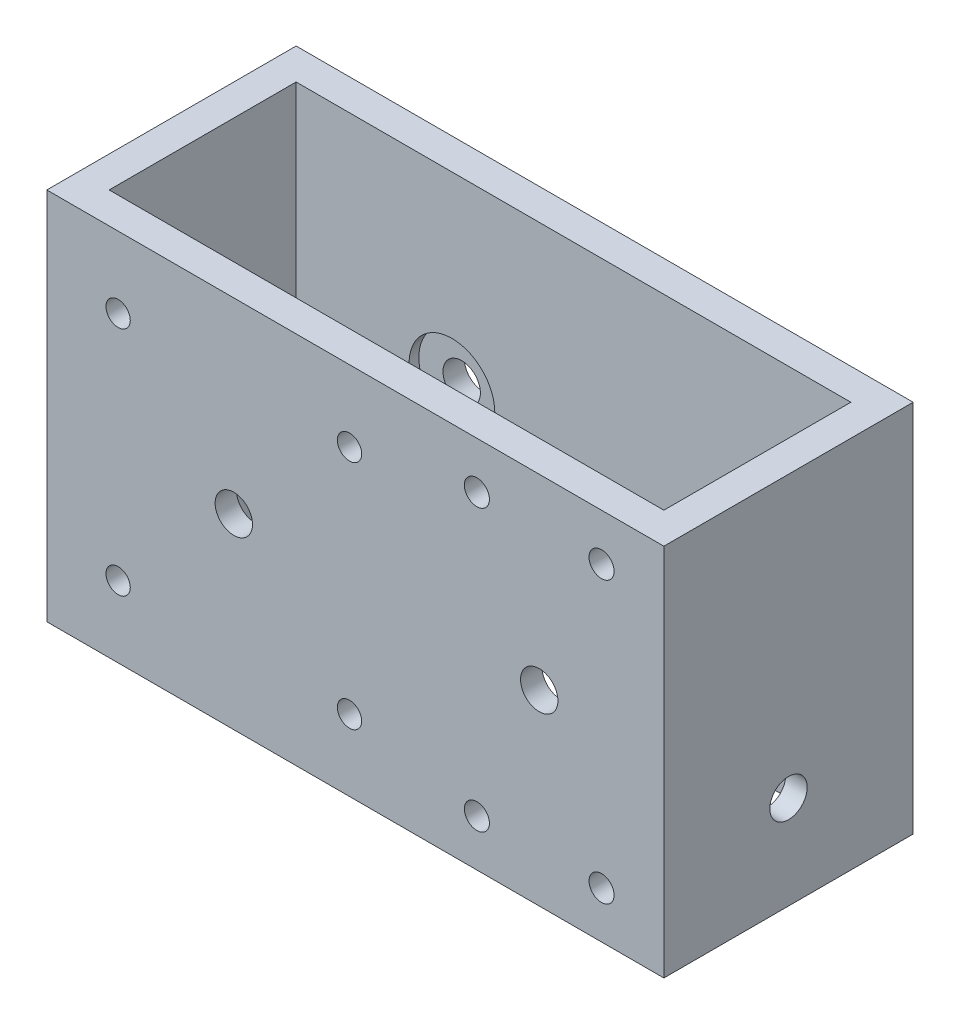
ISO-10303-21;
HEADER;
FILE_DESCRIPTION(('STEP AP214'),'2;1');
FILE_NAME('part.step','',(''),(''),'','','');
FILE_SCHEMA(('AUTOMOTIVE_DESIGN { 1 0 10303 214 1 1 1 1 }'));
ENDSEC;
DATA;
#1=APPLICATION_CONTEXT('core data for automotive mechanical design processes');
#2=APPLICATION_PROTOCOL_DEFINITION('international standard','automotive_design',2000,#1);
#3=PRODUCT_CONTEXT('',#1,'mechanical');
#4=PRODUCT('Part','Part','',(#3));
#5=PRODUCT_RELATED_PRODUCT_CATEGORY('part','',(#4));
#6=PRODUCT_DEFINITION_FORMATION('','',#4);
#7=PRODUCT_DEFINITION_CONTEXT('part definition',#1,'design');
#8=PRODUCT_DEFINITION('design','',#6,#7);
#9=PRODUCT_DEFINITION_SHAPE('','',#8);
#10=(LENGTH_UNIT() NAMED_UNIT(*) SI_UNIT(.MILLI.,.METRE.));
#11=(NAMED_UNIT(*) PLANE_ANGLE_UNIT() SI_UNIT($,.RADIAN.));
#12=(NAMED_UNIT(*) SI_UNIT($,.STERADIAN.) SOLID_ANGLE_UNIT());
#13=UNCERTAINTY_MEASURE_WITH_UNIT(LENGTH_MEASURE(1.E-05),#10,'distance_accuracy_value','');
#14=(GEOMETRIC_REPRESENTATION_CONTEXT(3) GLOBAL_UNCERTAINTY_ASSIGNED_CONTEXT((#13)) GLOBAL_UNIT_ASSIGNED_CONTEXT((#10,
#11,#12)) REPRESENTATION_CONTEXT('',''));
#15=CARTESIAN_POINT('',(0.,0.,0.));
#16=DIRECTION('',(0.,0.,1.));
#17=DIRECTION('',(1.,0.,0.));
#18=AXIS2_PLACEMENT_3D('',#15,#16,#17);
#19=CARTESIAN_POINT('',(38.1,38.1,0.));
#20=DIRECTION('',(0.,0.,1.));
#21=DIRECTION('',(1.,0.,0.));
#22=AXIS2_PLACEMENT_3D('',#19,#20,#21);
#23=CYLINDRICAL_SURFACE('',#22,3.81);
#24=CARTESIAN_POINT('',(38.1,38.1,0.));
#25=DIRECTION('',(0.,0.,1.));
#26=DIRECTION('',(1.,0.,0.));
#27=AXIS2_PLACEMENT_3D('',#24,#25,#26);
#28=CIRCLE('',#27,3.81);
#29=CARTESIAN_POINT('',(41.91,38.1,0.));
#30=VERTEX_POINT('',#29);
#31=EDGE_CURVE('E288',#30,#30,#28,.T.);
#32=ORIENTED_EDGE('',*,*,#31,.F.);
#33=EDGE_LOOP('',(#32));
#34=FACE_BOUND('',#33,.T.);
#35=CARTESIAN_POINT('',(38.1,38.1,4.365625));
#36=DIRECTION('',(0.,0.,1.));
#37=DIRECTION('',(1.,0.,0.));
#38=AXIS2_PLACEMENT_3D('',#35,#36,#37);
#39=CIRCLE('',#38,3.81);
#40=CARTESIAN_POINT('',(41.91,38.1,4.365625));
#41=VERTEX_POINT('',#40);
#42=EDGE_CURVE('E43',#41,#41,#39,.F.);
#43=ORIENTED_EDGE('',*,*,#42,.F.);
#44=EDGE_LOOP('',(#43));
#45=FACE_BOUND('',#44,.T.);
#46=ADVANCED_FACE('F39',(#34,#45),#23,.F.);
#47=CARTESIAN_POINT('',(100.33,38.1,0.));
#48=DIRECTION('',(0.,0.,1.));
#49=DIRECTION('',(1.,0.,0.));
#50=AXIS2_PLACEMENT_3D('',#47,#48,#49);
#51=CYLINDRICAL_SURFACE('',#50,3.81);
#52=CARTESIAN_POINT('',(100.33,38.1,0.));
#53=DIRECTION('',(0.,0.,1.));
#54=DIRECTION('',(1.,0.,0.));
#55=AXIS2_PLACEMENT_3D('',#52,#53,#54);
#56=CIRCLE('',#55,3.81);
#57=CARTESIAN_POINT('',(104.14,38.1,0.));
#58=VERTEX_POINT('',#57);
#59=EDGE_CURVE('E280',#58,#58,#56,.T.);
#60=ORIENTED_EDGE('',*,*,#59,.F.);
#61=EDGE_LOOP('',(#60));
#62=FACE_BOUND('',#61,.T.);
#63=CARTESIAN_POINT('',(100.33,38.1,4.365625));
#64=DIRECTION('',(0.,0.,1.));
#65=DIRECTION('',(1.,0.,0.));
#66=AXIS2_PLACEMENT_3D('',#63,#64,#65);
#67=CIRCLE('',#66,3.81);
#68=CARTESIAN_POINT('',(104.14,38.1,4.365625));
#69=VERTEX_POINT('',#68);
#70=EDGE_CURVE('E215',#69,#69,#67,.F.);
#71=ORIENTED_EDGE('',*,*,#70,.F.);
#72=EDGE_LOOP('',(#71));
#73=FACE_BOUND('',#72,.T.);
#74=ADVANCED_FACE('F365',(#62,#73),#51,.F.);
#75=CARTESIAN_POINT('',(125.73,19.05,25.4));
#76=DIRECTION('',(-1.,0.,0.));
#77=DIRECTION('',(0.,0.,1.));
#78=AXIS2_PLACEMENT_3D('',#75,#76,#77);
#79=CYLINDRICAL_SURFACE('',#78,3.81);
#80=CARTESIAN_POINT('',(125.73,19.05,25.4));
#81=DIRECTION('',(-1.,0.,0.));
#82=DIRECTION('',(0.,0.,1.));
#83=AXIS2_PLACEMENT_3D('',#80,#81,#82);
#84=CIRCLE('',#83,3.81);
#85=CARTESIAN_POINT('',(125.73,19.05,29.21));
#86=VERTEX_POINT('',#85);
#87=EDGE_CURVE('E272',#86,#86,#84,.T.);
#88=ORIENTED_EDGE('',*,*,#87,.F.);
#89=EDGE_LOOP('',(#88));
#90=FACE_BOUND('',#89,.T.);
#91=CARTESIAN_POINT('',(121.364375,19.05,25.4));
#92=DIRECTION('',(-1.,0.,0.));
#93=DIRECTION('',(0.,0.,1.));
#94=AXIS2_PLACEMENT_3D('',#91,#92,#93);
#95=CIRCLE('',#94,3.81);
#96=CARTESIAN_POINT('',(121.364375,19.05,29.21));
#97=VERTEX_POINT('',#96);
#98=EDGE_CURVE('E210',#97,#97,#95,.F.);
#99=ORIENTED_EDGE('',*,*,#98,.F.);
#100=EDGE_LOOP('',(#99));
#101=FACE_BOUND('',#100,.T.);
#102=ADVANCED_FACE('F362',(#90,#101),#79,.F.);
#103=CARTESIAN_POINT('',(38.1,38.1,50.8));
#104=DIRECTION('',(0.,0.,1.));
#105=DIRECTION('',(1.,0.,0.));
#106=AXIS2_PLACEMENT_3D('',#103,#104,#105);
#107=CIRCLE('',#106,3.81);
#108=CARTESIAN_POINT('',(41.91,38.1,50.8));
#109=VERTEX_POINT('',#108);
#110=EDGE_CURVE('E284',#109,#109,#107,.T.);
#111=ORIENTED_EDGE('',*,*,#110,.T.);
#112=EDGE_LOOP('',(#111));
#113=FACE_BOUND('',#112,.T.);
#114=CARTESIAN_POINT('',(38.1,38.1,46.434375));
#115=DIRECTION('',(0.,0.,-1.));
#116=DIRECTION('',(-1.,0.,0.));
#117=AXIS2_PLACEMENT_3D('',#114,#115,#116);
#118=CIRCLE('',#117,3.81);
#119=CARTESIAN_POINT('',(34.29,38.1,46.434375));
#120=VERTEX_POINT('',#119);
#121=EDGE_CURVE('E204',#120,#120,#118,.F.);
#122=ORIENTED_EDGE('',*,*,#121,.F.);
#123=EDGE_LOOP('',(#122));
#124=FACE_BOUND('',#123,.T.);
#125=ADVANCED_FACE('F368',(#113,#124),#23,.F.);
#126=CARTESIAN_POINT('',(100.33,38.1,50.8));
#127=DIRECTION('',(0.,0.,1.));
#128=DIRECTION('',(1.,0.,0.));
#129=AXIS2_PLACEMENT_3D('',#126,#127,#128);
#130=CIRCLE('',#129,3.81);
#131=CARTESIAN_POINT('',(104.14,38.1,50.8));
#132=VERTEX_POINT('',#131);
#133=EDGE_CURVE('E276',#132,#132,#130,.T.);
#134=ORIENTED_EDGE('',*,*,#133,.T.);
#135=EDGE_LOOP('',(#134));
#136=FACE_BOUND('',#135,.T.);
#137=CARTESIAN_POINT('',(100.33,38.1,46.434375));
#138=DIRECTION('',(0.,0.,-1.));
#139=DIRECTION('',(-1.,0.,0.));
#140=AXIS2_PLACEMENT_3D('',#137,#138,#139);
#141=CIRCLE('',#140,3.81);
#142=CARTESIAN_POINT('',(96.52,38.1,46.434375));
#143=VERTEX_POINT('',#142);
#144=EDGE_CURVE('E200',#143,#143,#141,.F.);
#145=ORIENTED_EDGE('',*,*,#144,.F.);
#146=EDGE_LOOP('',(#145));
#147=FACE_BOUND('',#146,.T.);
#148=ADVANCED_FACE('F359',(#136,#147),#51,.F.);
#149=CARTESIAN_POINT('',(0.,19.05,25.4));
#150=DIRECTION('',(-1.,0.,0.));
#151=DIRECTION('',(0.,0.,1.));
#152=AXIS2_PLACEMENT_3D('',#149,#150,#151);
#153=CIRCLE('',#152,3.81);
#154=CARTESIAN_POINT('',(0.,19.05,29.21));
#155=VERTEX_POINT('',#154);
#156=EDGE_CURVE('E198',#155,#155,#153,.T.);
#157=ORIENTED_EDGE('',*,*,#156,.T.);
#158=EDGE_LOOP('',(#157));
#159=FACE_BOUND('',#158,.T.);
#160=CARTESIAN_POINT('',(4.365625,19.05,25.4));
#161=DIRECTION('',(1.,0.,0.));
#162=DIRECTION('',(0.,0.,-1.));
#163=AXIS2_PLACEMENT_3D('',#160,#161,#162);
#164=CIRCLE('',#163,3.81);
#165=CARTESIAN_POINT('',(4.365625,19.05,21.59));
#166=VERTEX_POINT('',#165);
#167=EDGE_CURVE('E194',#166,#166,#164,.F.);
#168=ORIENTED_EDGE('',*,*,#167,.F.);
#169=EDGE_LOOP('',(#168));
#170=FACE_BOUND('',#169,.T.);
#171=ADVANCED_FACE('F352',(#159,#170),#79,.F.);
#172=CARTESIAN_POINT('',(0.,76.2,0.));
#173=DIRECTION('',(0.,1.,0.));
#174=DIRECTION('',(0.,0.,1.));
#175=AXIS2_PLACEMENT_3D('',#172,#173,#174);
#176=PLANE('',#175);
#177=DIRECTION('',(0.,0.,1.));
#178=VECTOR('',#177,1.);
#179=CARTESIAN_POINT('',(0.,76.2,0.));
#180=LINE('',#179,#178);
#181=CARTESIAN_POINT('',(0.,76.2,0.));
#182=VERTEX_POINT('',#181);
#183=CARTESIAN_POINT('',(0.,76.2,50.8));
#184=VERTEX_POINT('',#183);
#185=EDGE_CURVE('E158',#182,#184,#180,.T.);
#186=ORIENTED_EDGE('',*,*,#185,.T.);
#187=DIRECTION('',(1.,0.,0.));
#188=VECTOR('',#187,1.);
#189=CARTESIAN_POINT('',(0.,76.2,50.8));
#190=LINE('',#189,#188);
#191=CARTESIAN_POINT('',(125.73,76.2,50.8));
#192=VERTEX_POINT('',#191);
#193=EDGE_CURVE('E162',#184,#192,#190,.T.);
#194=ORIENTED_EDGE('',*,*,#193,.T.);
#195=DIRECTION('',(0.,0.,-1.));
#196=VECTOR('',#195,1.);
#197=CARTESIAN_POINT('',(125.73,76.2,0.));
#198=LINE('',#197,#196);
#199=CARTESIAN_POINT('',(125.73,76.2,0.));
#200=VERTEX_POINT('',#199);
#201=EDGE_CURVE('E166',#192,#200,#198,.T.);
#202=ORIENTED_EDGE('',*,*,#201,.T.);
#203=DIRECTION('',(-1.,0.,0.));
#204=VECTOR('',#203,1.);
#205=CARTESIAN_POINT('',(0.,76.2,0.));
#206=LINE('',#205,#204);
#207=EDGE_CURVE('E169',#200,#182,#206,.T.);
#208=ORIENTED_EDGE('',*,*,#207,.T.);
#209=EDGE_LOOP('',(#186,#194,#202,#208));
#210=FACE_BOUND('',#209,.T.);
#211=DIRECTION('',(1.,0.,0.));
#212=VECTOR('',#211,1.);
#213=CARTESIAN_POINT('',(119.38,76.2,44.45));
#214=LINE('',#213,#212);
#215=CARTESIAN_POINT('',(6.35,76.2,44.45));
#216=VERTEX_POINT('',#215);
#217=CARTESIAN_POINT('',(119.38,76.2,44.45));
#218=VERTEX_POINT('',#217);
#219=EDGE_CURVE('E116',#216,#218,#214,.T.);
#220=ORIENTED_EDGE('',*,*,#219,.F.);
#221=DIRECTION('',(0.,0.,1.));
#222=VECTOR('',#221,1.);
#223=CARTESIAN_POINT('',(6.35,76.2,44.45));
#224=LINE('',#223,#222);
#225=CARTESIAN_POINT('',(6.35,76.2,6.35));
#226=VERTEX_POINT('',#225);
#227=EDGE_CURVE('E107',#226,#216,#224,.T.);
#228=ORIENTED_EDGE('',*,*,#227,.F.);
#229=DIRECTION('',(-1.,0.,0.));
#230=VECTOR('',#229,1.);
#231=CARTESIAN_POINT('',(119.38,76.2,6.35));
#232=LINE('',#231,#230);
#233=CARTESIAN_POINT('',(119.38,76.2,6.35));
#234=VERTEX_POINT('',#233);
#235=EDGE_CURVE('E134',#234,#226,#232,.T.);
#236=ORIENTED_EDGE('',*,*,#235,.F.);
#237=DIRECTION('',(0.,0.,-1.));
#238=VECTOR('',#237,1.);
#239=CARTESIAN_POINT('',(119.38,76.2,44.45));
#240=LINE('',#239,#238);
#241=EDGE_CURVE('E130',#218,#234,#240,.T.);
#242=ORIENTED_EDGE('',*,*,#241,.F.);
#243=EDGE_LOOP('',(#220,#228,#236,#242));
#244=FACE_BOUND('',#243,.T.);
#245=ADVANCED_FACE('F129',(#210,#244),#176,.T.);
#246=CARTESIAN_POINT('',(0.,0.,0.));
#247=DIRECTION('',(0.,1.,0.));
#248=DIRECTION('',(0.,0.,1.));
#249=AXIS2_PLACEMENT_3D('',#246,#247,#248);
#250=PLANE('',#249);
#251=DIRECTION('',(0.,0.,1.));
#252=VECTOR('',#251,1.);
#253=CARTESIAN_POINT('',(0.,0.,0.));
#254=LINE('',#253,#252);
#255=CARTESIAN_POINT('',(0.,0.,0.));
#256=VERTEX_POINT('',#255);
#257=CARTESIAN_POINT('',(0.,0.,50.8));
#258=VERTEX_POINT('',#257);
#259=EDGE_CURVE('E125',#256,#258,#254,.T.);
#260=ORIENTED_EDGE('',*,*,#259,.F.);
#261=DIRECTION('',(-1.,0.,0.));
#262=VECTOR('',#261,1.);
#263=CARTESIAN_POINT('',(0.,0.,0.));
#264=LINE('',#263,#262);
#265=CARTESIAN_POINT('',(125.73,0.,0.));
#266=VERTEX_POINT('',#265);
#267=EDGE_CURVE('E163',#266,#256,#264,.T.);
#268=ORIENTED_EDGE('',*,*,#267,.F.);
#269=DIRECTION('',(0.,0.,-1.));
#270=VECTOR('',#269,1.);
#271=CARTESIAN_POINT('',(125.73,0.,0.));
#272=LINE('',#271,#270);
#273=CARTESIAN_POINT('',(125.73,0.,50.8));
#274=VERTEX_POINT('',#273);
#275=EDGE_CURVE('E179',#274,#266,#272,.T.);
#276=ORIENTED_EDGE('',*,*,#275,.F.);
#277=DIRECTION('',(1.,0.,0.));
#278=VECTOR('',#277,1.);
#279=CARTESIAN_POINT('',(0.,0.,50.8));
#280=LINE('',#279,#278);
#281=EDGE_CURVE('E176',#258,#274,#280,.T.);
#282=ORIENTED_EDGE('',*,*,#281,.F.);
#283=EDGE_LOOP('',(#260,#268,#276,#282));
#284=FACE_BOUND('',#283,.T.);
#285=DIRECTION('',(0.,0.,1.));
#286=VECTOR('',#285,1.);
#287=CARTESIAN_POINT('',(6.35,0.,44.45));
#288=LINE('',#287,#286);
#289=CARTESIAN_POINT('',(6.35,0.,6.35));
#290=VERTEX_POINT('',#289);
#291=CARTESIAN_POINT('',(6.35,0.,44.45));
#292=VERTEX_POINT('',#291);
#293=EDGE_CURVE('E65',#290,#292,#288,.T.);
#294=ORIENTED_EDGE('',*,*,#293,.T.);
#295=DIRECTION('',(1.,0.,0.));
#296=VECTOR('',#295,1.);
#297=CARTESIAN_POINT('',(119.38,0.,44.45));
#298=LINE('',#297,#296);
#299=CARTESIAN_POINT('',(119.38,0.,44.45));
#300=VERTEX_POINT('',#299);
#301=EDGE_CURVE('E123',#292,#300,#298,.T.);
#302=ORIENTED_EDGE('',*,*,#301,.T.);
#303=DIRECTION('',(0.,0.,-1.));
#304=VECTOR('',#303,1.);
#305=CARTESIAN_POINT('',(119.38,0.,44.45));
#306=LINE('',#305,#304);
#307=CARTESIAN_POINT('',(119.38,0.,6.35));
#308=VERTEX_POINT('',#307);
#309=EDGE_CURVE('E145',#300,#308,#306,.T.);
#310=ORIENTED_EDGE('',*,*,#309,.T.);
#311=DIRECTION('',(-1.,0.,0.));
#312=VECTOR('',#311,1.);
#313=CARTESIAN_POINT('',(119.38,0.,6.35));
#314=LINE('',#313,#312);
#315=EDGE_CURVE('E117',#308,#290,#314,.T.);
#316=ORIENTED_EDGE('',*,*,#315,.T.);
#317=EDGE_LOOP('',(#294,#302,#310,#316));
#318=FACE_BOUND('',#317,.T.);
#319=ADVANCED_FACE('F342',(#284,#318),#250,.F.);
#320=CARTESIAN_POINT('',(0.,76.2,0.));
#321=DIRECTION('',(1.,0.,0.));
#322=DIRECTION('',(0.,0.,-1.));
#323=AXIS2_PLACEMENT_3D('',#320,#321,#322);
#324=PLANE('',#323);
#325=ORIENTED_EDGE('',*,*,#156,.F.);
#326=EDGE_LOOP('',(#325));
#327=FACE_BOUND('',#326,.T.);
#328=ORIENTED_EDGE('',*,*,#259,.T.);
#329=DIRECTION('',(0.,-1.,0.));
#330=VECTOR('',#329,1.);
#331=CARTESIAN_POINT('',(0.,76.2,50.8));
#332=LINE('',#331,#330);
#333=EDGE_CURVE('E11',#184,#258,#332,.T.);
#334=ORIENTED_EDGE('',*,*,#333,.F.);
#335=ORIENTED_EDGE('',*,*,#185,.F.);
#336=DIRECTION('',(0.,-1.,0.));
#337=VECTOR('',#336,1.);
#338=CARTESIAN_POINT('',(0.,76.2,0.));
#339=LINE('',#338,#337);
#340=EDGE_CURVE('E172',#182,#256,#339,.T.);
#341=ORIENTED_EDGE('',*,*,#340,.T.);
#342=EDGE_LOOP('',(#328,#334,#335,#341));
#343=FACE_BOUND('',#342,.T.);
#344=ADVANCED_FACE('F41',(#327,#343),#324,.F.);
#345=CARTESIAN_POINT('',(0.,76.2,50.8));
#346=DIRECTION('',(0.,0.,-1.));
#347=DIRECTION('',(-1.,0.,0.));
#348=AXIS2_PLACEMENT_3D('',#345,#346,#347);
#349=PLANE('',#348);
#350=CARTESIAN_POINT('',(87.63,66.675,50.8));
#351=DIRECTION('',(0.,0.,-1.));
#352=DIRECTION('',(-1.,0.,0.));
#353=AXIS2_PLACEMENT_3D('',#350,#351,#352);
#354=CIRCLE('',#353,2.55270000000003);
#355=CARTESIAN_POINT('',(85.0773,66.675,50.8));
#356=VERTEX_POINT('',#355);
#357=EDGE_CURVE('E667',#356,#356,#354,.T.);
#358=ORIENTED_EDGE('',*,*,#357,.T.);
#359=EDGE_LOOP('',(#358));
#360=FACE_BOUND('',#359,.T.);
#361=CARTESIAN_POINT('',(113.03,66.675,50.8));
#362=DIRECTION('',(0.,0.,-1.));
#363=DIRECTION('',(-1.,0.,0.));
#364=AXIS2_PLACEMENT_3D('',#361,#362,#363);
#365=CIRCLE('',#364,2.55270000000003);
#366=CARTESIAN_POINT('',(110.4773,66.675,50.8));
#367=VERTEX_POINT('',#366);
#368=EDGE_CURVE('E694',#367,#367,#365,.T.);
#369=ORIENTED_EDGE('',*,*,#368,.T.);
#370=EDGE_LOOP('',(#369));
#371=FACE_BOUND('',#370,.T.);
#372=CARTESIAN_POINT('',(113.03,9.52500000000001,50.8));
#373=DIRECTION('',(0.,0.,-1.));
#374=DIRECTION('',(-1.,0.,0.));
#375=AXIS2_PLACEMENT_3D('',#372,#373,#374);
#376=CIRCLE('',#375,2.55270000000001);
#377=CARTESIAN_POINT('',(110.4773,9.52500000000001,50.8));
#378=VERTEX_POINT('',#377);
#379=EDGE_CURVE('E683',#378,#378,#376,.T.);
#380=ORIENTED_EDGE('',*,*,#379,.T.);
#381=EDGE_LOOP('',(#380));
#382=FACE_BOUND('',#381,.T.);
#383=CARTESIAN_POINT('',(87.63,9.52500000000001,50.8));
#384=DIRECTION('',(0.,0.,-1.));
#385=DIRECTION('',(-1.,0.,0.));
#386=AXIS2_PLACEMENT_3D('',#383,#384,#385);
#387=CIRCLE('',#386,2.55270000000001);
#388=CARTESIAN_POINT('',(85.0773,9.52500000000001,50.8));
#389=VERTEX_POINT('',#388);
#390=EDGE_CURVE('E245',#389,#389,#387,.T.);
#391=ORIENTED_EDGE('',*,*,#390,.T.);
#392=EDGE_LOOP('',(#391));
#393=FACE_BOUND('',#392,.T.);
#394=ORIENTED_EDGE('',*,*,#133,.F.);
#395=EDGE_LOOP('',(#394));
#396=FACE_BOUND('',#395,.T.);
#397=ORIENTED_EDGE('',*,*,#110,.F.);
#398=EDGE_LOOP('',(#397));
#399=FACE_BOUND('',#398,.T.);
#400=CARTESIAN_POINT('',(14.5268276821935,14.5268276821935,50.8));
#401=DIRECTION('',(0.,0.,1.));
#402=DIRECTION('',(1.,0.,0.));
#403=AXIS2_PLACEMENT_3D('',#400,#401,#402);
#404=CIRCLE('',#403,2.4765);
#405=CARTESIAN_POINT('',(17.0033276821935,14.5268276821935,50.8));
#406=VERTEX_POINT('',#405);
#407=EDGE_CURVE('E292',#406,#406,#404,.T.);
#408=ORIENTED_EDGE('',*,*,#407,.F.);
#409=EDGE_LOOP('',(#408));
#410=FACE_BOUND('',#409,.T.);
#411=CARTESIAN_POINT('',(61.6731723178065,14.5268276821935,50.8));
#412=DIRECTION('',(0.,0.,1.));
#413=DIRECTION('',(1.,0.,0.));
#414=AXIS2_PLACEMENT_3D('',#411,#412,#413);
#415=CIRCLE('',#414,2.4765);
#416=CARTESIAN_POINT('',(64.1496723178065,14.5268276821935,50.8));
#417=VERTEX_POINT('',#416);
#418=EDGE_CURVE('E306',#417,#417,#415,.T.);
#419=ORIENTED_EDGE('',*,*,#418,.F.);
#420=EDGE_LOOP('',(#419));
#421=FACE_BOUND('',#420,.T.);
#422=CARTESIAN_POINT('',(61.6731723178065,61.6731723178065,50.8));
#423=DIRECTION('',(0.,0.,1.));
#424=DIRECTION('',(1.,0.,0.));
#425=AXIS2_PLACEMENT_3D('',#422,#423,#424);
#426=CIRCLE('',#425,2.4765);
#427=CARTESIAN_POINT('',(64.1496723178065,61.6731723178065,50.8));
#428=VERTEX_POINT('',#427);
#429=EDGE_CURVE('E296',#428,#428,#426,.T.);
#430=ORIENTED_EDGE('',*,*,#429,.F.);
#431=EDGE_LOOP('',(#430));
#432=FACE_BOUND('',#431,.T.);
#433=CARTESIAN_POINT('',(14.5268276821935,61.6731723178065,50.8));
#434=DIRECTION('',(0.,0.,1.));
#435=DIRECTION('',(1.,0.,0.));
#436=AXIS2_PLACEMENT_3D('',#433,#434,#435);
#437=CIRCLE('',#436,2.47649999999999);
#438=CARTESIAN_POINT('',(17.0033276821935,61.6731723178065,50.8));
#439=VERTEX_POINT('',#438);
#440=EDGE_CURVE('E142',#439,#439,#437,.T.);
#441=ORIENTED_EDGE('',*,*,#440,.F.);
#442=EDGE_LOOP('',(#441));
#443=FACE_BOUND('',#442,.T.);
#444=ORIENTED_EDGE('',*,*,#281,.T.);
#445=DIRECTION('',(0.,-1.,0.));
#446=VECTOR('',#445,1.);
#447=CARTESIAN_POINT('',(125.73,76.2,50.8));
#448=LINE('',#447,#446);
#449=EDGE_CURVE('E49',#192,#274,#448,.T.);
#450=ORIENTED_EDGE('',*,*,#449,.F.);
#451=ORIENTED_EDGE('',*,*,#193,.F.);
#452=ORIENTED_EDGE('',*,*,#333,.T.);
#453=EDGE_LOOP('',(#444,#450,#451,#452));
#454=FACE_BOUND('',#453,.T.);
#455=ADVANCED_FACE('F328',(#360,#371,#382,#393,#396,#399,#410,#421,#432,#443,#454),#349,.F.);
#456=CARTESIAN_POINT('',(125.73,76.2,0.));
#457=DIRECTION('',(-1.,0.,0.));
#458=DIRECTION('',(0.,0.,1.));
#459=AXIS2_PLACEMENT_3D('',#456,#457,#458);
#460=PLANE('',#459);
#461=ORIENTED_EDGE('',*,*,#87,.T.);
#462=EDGE_LOOP('',(#461));
#463=FACE_BOUND('',#462,.T.);
#464=ORIENTED_EDGE('',*,*,#275,.T.);
#465=DIRECTION('',(0.,-1.,0.));
#466=VECTOR('',#465,1.);
#467=CARTESIAN_POINT('',(125.73,76.2,0.));
#468=LINE('',#467,#466);
#469=EDGE_CURVE('E187',#200,#266,#468,.T.);
#470=ORIENTED_EDGE('',*,*,#469,.F.);
#471=ORIENTED_EDGE('',*,*,#201,.F.);
#472=ORIENTED_EDGE('',*,*,#449,.T.);
#473=EDGE_LOOP('',(#464,#470,#471,#472));
#474=FACE_BOUND('',#473,.T.);
#475=ADVANCED_FACE('F331',(#463,#474),#460,.F.);
#476=CARTESIAN_POINT('',(0.,76.2,0.));
#477=DIRECTION('',(0.,0.,1.));
#478=DIRECTION('',(1.,0.,0.));
#479=AXIS2_PLACEMENT_3D('',#476,#477,#478);
#480=PLANE('',#479);
#481=ORIENTED_EDGE('',*,*,#59,.T.);
#482=EDGE_LOOP('',(#481));
#483=FACE_BOUND('',#482,.T.);
#484=ORIENTED_EDGE('',*,*,#31,.T.);
#485=EDGE_LOOP('',(#484));
#486=FACE_BOUND('',#485,.T.);
#487=ORIENTED_EDGE('',*,*,#267,.T.);
#488=ORIENTED_EDGE('',*,*,#340,.F.);
#489=ORIENTED_EDGE('',*,*,#207,.F.);
#490=ORIENTED_EDGE('',*,*,#469,.T.);
#491=EDGE_LOOP('',(#487,#488,#489,#490));
#492=FACE_BOUND('',#491,.T.);
#493=ADVANCED_FACE('F346',(#483,#486,#492),#480,.F.);
#494=CARTESIAN_POINT('',(6.35,76.2,44.45));
#495=DIRECTION('',(1.,0.,0.));
#496=DIRECTION('',(0.,0.,-1.));
#497=AXIS2_PLACEMENT_3D('',#494,#495,#496);
#498=PLANE('',#497);
#499=CARTESIAN_POINT('',(6.35,19.05,25.4));
#500=DIRECTION('',(1.,0.,0.));
#501=DIRECTION('',(0.,0.,-1.));
#502=AXIS2_PLACEMENT_3D('',#499,#500,#501);
#503=CIRCLE('',#502,8.73125);
#504=CARTESIAN_POINT('',(6.35,19.05,16.66875));
#505=VERTEX_POINT('',#504);
#506=EDGE_CURVE('E209',#505,#505,#503,.T.);
#507=ORIENTED_EDGE('',*,*,#506,.F.);
#508=EDGE_LOOP('',(#507));
#509=FACE_BOUND('',#508,.T.);
#510=ORIENTED_EDGE('',*,*,#293,.F.);
#511=DIRECTION('',(0.,-1.,0.));
#512=VECTOR('',#511,1.);
#513=CARTESIAN_POINT('',(6.35,76.2,6.35));
#514=LINE('',#513,#512);
#515=EDGE_CURVE('E111',#226,#290,#514,.T.);
#516=ORIENTED_EDGE('',*,*,#515,.F.);
#517=ORIENTED_EDGE('',*,*,#227,.T.);
#518=DIRECTION('',(0.,-1.,0.));
#519=VECTOR('',#518,1.);
#520=CARTESIAN_POINT('',(6.35,76.2,44.45));
#521=LINE('',#520,#519);
#522=EDGE_CURVE('E110',#216,#292,#521,.T.);
#523=ORIENTED_EDGE('',*,*,#522,.T.);
#524=EDGE_LOOP('',(#510,#516,#517,#523));
#525=FACE_BOUND('',#524,.T.);
#526=ADVANCED_FACE('F109',(#509,#525),#498,.T.);
#527=CARTESIAN_POINT('',(119.38,76.2,44.45));
#528=DIRECTION('',(0.,0.,-1.));
#529=DIRECTION('',(-1.,0.,0.));
#530=AXIS2_PLACEMENT_3D('',#527,#528,#529);
#531=PLANE('',#530);
#532=CARTESIAN_POINT('',(87.63,66.675,44.45));
#533=DIRECTION('',(0.,0.,-1.));
#534=DIRECTION('',(-1.,0.,0.));
#535=AXIS2_PLACEMENT_3D('',#532,#533,#534);
#536=CIRCLE('',#535,2.55270000000003);
#537=CARTESIAN_POINT('',(85.0773,66.675,44.45));
#538=VERTEX_POINT('',#537);
#539=EDGE_CURVE('E670',#538,#538,#536,.T.);
#540=ORIENTED_EDGE('',*,*,#539,.F.);
#541=EDGE_LOOP('',(#540));
#542=FACE_BOUND('',#541,.T.);
#543=CARTESIAN_POINT('',(113.03,66.675,44.45));
#544=DIRECTION('',(0.,0.,-1.));
#545=DIRECTION('',(-1.,0.,0.));
#546=AXIS2_PLACEMENT_3D('',#543,#544,#545);
#547=CIRCLE('',#546,2.55270000000003);
#548=CARTESIAN_POINT('',(110.4773,66.675,44.45));
#549=VERTEX_POINT('',#548);
#550=EDGE_CURVE('E674',#549,#549,#547,.T.);
#551=ORIENTED_EDGE('',*,*,#550,.F.);
#552=EDGE_LOOP('',(#551));
#553=FACE_BOUND('',#552,.T.);
#554=CARTESIAN_POINT('',(113.03,9.52500000000001,44.45));
#555=DIRECTION('',(0.,0.,-1.));
#556=DIRECTION('',(-1.,0.,0.));
#557=AXIS2_PLACEMENT_3D('',#554,#555,#556);
#558=CIRCLE('',#557,2.55270000000001);
#559=CARTESIAN_POINT('',(110.4773,9.52500000000001,44.45));
#560=VERTEX_POINT('',#559);
#561=EDGE_CURVE('E688',#560,#560,#558,.T.);
#562=ORIENTED_EDGE('',*,*,#561,.F.);
#563=EDGE_LOOP('',(#562));
#564=FACE_BOUND('',#563,.T.);
#565=CARTESIAN_POINT('',(87.63,9.52500000000001,44.45));
#566=DIRECTION('',(0.,0.,-1.));
#567=DIRECTION('',(-1.,0.,0.));
#568=AXIS2_PLACEMENT_3D('',#565,#566,#567);
#569=CIRCLE('',#568,2.55270000000001);
#570=CARTESIAN_POINT('',(85.0773,9.52500000000001,44.45));
#571=VERTEX_POINT('',#570);
#572=EDGE_CURVE('E235',#571,#571,#569,.T.);
#573=ORIENTED_EDGE('',*,*,#572,.F.);
#574=EDGE_LOOP('',(#573));
#575=FACE_BOUND('',#574,.T.);
#576=CARTESIAN_POINT('',(38.1,38.1,44.45));
#577=DIRECTION('',(0.,0.,-1.));
#578=DIRECTION('',(-1.,0.,0.));
#579=AXIS2_PLACEMENT_3D('',#576,#577,#578);
#580=CIRCLE('',#579,8.73125);
#581=CARTESIAN_POINT('',(29.36875,38.1,44.45));
#582=VERTEX_POINT('',#581);
#583=EDGE_CURVE('E255',#582,#582,#580,.T.);
#584=ORIENTED_EDGE('',*,*,#583,.F.);
#585=EDGE_LOOP('',(#584));
#586=FACE_BOUND('',#585,.T.);
#587=CARTESIAN_POINT('',(100.33,38.1,44.45));
#588=DIRECTION('',(0.,0.,-1.));
#589=DIRECTION('',(-1.,0.,0.));
#590=AXIS2_PLACEMENT_3D('',#587,#588,#589);
#591=CIRCLE('',#590,8.73125);
#592=CARTESIAN_POINT('',(91.59875,38.1,44.45));
#593=VERTEX_POINT('',#592);
#594=EDGE_CURVE('E213',#593,#593,#591,.T.);
#595=ORIENTED_EDGE('',*,*,#594,.F.);
#596=EDGE_LOOP('',(#595));
#597=FACE_BOUND('',#596,.T.);
#598=CARTESIAN_POINT('',(14.5268276821935,14.5268276821935,44.45));
#599=DIRECTION('',(0.,0.,-1.));
#600=DIRECTION('',(-1.,0.,0.));
#601=AXIS2_PLACEMENT_3D('',#598,#599,#600);
#602=CIRCLE('',#601,2.4765);
#603=CARTESIAN_POINT('',(12.0503276821935,14.5268276821935,44.45));
#604=VERTEX_POINT('',#603);
#605=EDGE_CURVE('E310',#604,#604,#602,.F.);
#606=ORIENTED_EDGE('',*,*,#605,.T.);
#607=EDGE_LOOP('',(#606));
#608=FACE_BOUND('',#607,.T.);
#609=CARTESIAN_POINT('',(61.6731723178065,14.5268276821935,44.45));
#610=DIRECTION('',(0.,0.,-1.));
#611=DIRECTION('',(-1.,0.,0.));
#612=AXIS2_PLACEMENT_3D('',#609,#610,#611);
#613=CIRCLE('',#612,2.4765);
#614=CARTESIAN_POINT('',(59.1966723178065,14.5268276821935,44.45));
#615=VERTEX_POINT('',#614);
#616=EDGE_CURVE('E301',#615,#615,#613,.F.);
#617=ORIENTED_EDGE('',*,*,#616,.T.);
#618=EDGE_LOOP('',(#617));
#619=FACE_BOUND('',#618,.T.);
#620=CARTESIAN_POINT('',(61.6731723178065,61.6731723178065,44.45));
#621=DIRECTION('',(0.,0.,-1.));
#622=DIRECTION('',(-1.,0.,0.));
#623=AXIS2_PLACEMENT_3D('',#620,#621,#622);
#624=CIRCLE('',#623,2.4765);
#625=CARTESIAN_POINT('',(59.1966723178065,61.6731723178065,44.45));
#626=VERTEX_POINT('',#625);
#627=EDGE_CURVE('E300',#626,#626,#624,.F.);
#628=ORIENTED_EDGE('',*,*,#627,.T.);
#629=EDGE_LOOP('',(#628));
#630=FACE_BOUND('',#629,.T.);
#631=CARTESIAN_POINT('',(14.5268276821935,61.6731723178065,44.45));
#632=DIRECTION('',(0.,0.,-1.));
#633=DIRECTION('',(-1.,0.,0.));
#634=AXIS2_PLACEMENT_3D('',#631,#632,#633);
#635=CIRCLE('',#634,2.47649999999999);
#636=CARTESIAN_POINT('',(12.0503276821935,61.6731723178065,44.45));
#637=VERTEX_POINT('',#636);
#638=EDGE_CURVE('E305',#637,#637,#635,.F.);
#639=ORIENTED_EDGE('',*,*,#638,.T.);
#640=EDGE_LOOP('',(#639));
#641=FACE_BOUND('',#640,.T.);
#642=ORIENTED_EDGE('',*,*,#301,.F.);
#643=ORIENTED_EDGE('',*,*,#522,.F.);
#644=ORIENTED_EDGE('',*,*,#219,.T.);
#645=DIRECTION('',(0.,-1.,0.));
#646=VECTOR('',#645,1.);
#647=CARTESIAN_POINT('',(119.38,76.2,44.45));
#648=LINE('',#647,#646);
#649=EDGE_CURVE('E126',#218,#300,#648,.T.);
#650=ORIENTED_EDGE('',*,*,#649,.T.);
#651=EDGE_LOOP('',(#642,#643,#644,#650));
#652=FACE_BOUND('',#651,.T.);
#653=ADVANCED_FACE('F120',(#542,#553,#564,#575,#586,#597,#608,#619,#630,#641,#652),#531,.T.);
#654=CARTESIAN_POINT('',(119.38,76.2,44.45));
#655=DIRECTION('',(-1.,0.,0.));
#656=DIRECTION('',(0.,0.,1.));
#657=AXIS2_PLACEMENT_3D('',#654,#655,#656);
#658=PLANE('',#657);
#659=CARTESIAN_POINT('',(119.38,19.05,25.4));
#660=DIRECTION('',(-1.,0.,0.));
#661=DIRECTION('',(0.,0.,1.));
#662=AXIS2_PLACEMENT_3D('',#659,#660,#661);
#663=CIRCLE('',#662,8.73125);
#664=CARTESIAN_POINT('',(119.38,19.05,34.13125));
#665=VERTEX_POINT('',#664);
#666=EDGE_CURVE('E224',#665,#665,#663,.T.);
#667=ORIENTED_EDGE('',*,*,#666,.F.);
#668=EDGE_LOOP('',(#667));
#669=FACE_BOUND('',#668,.T.);
#670=ORIENTED_EDGE('',*,*,#309,.F.);
#671=ORIENTED_EDGE('',*,*,#649,.F.);
#672=ORIENTED_EDGE('',*,*,#241,.T.);
#673=DIRECTION('',(0.,-1.,0.));
#674=VECTOR('',#673,1.);
#675=CARTESIAN_POINT('',(119.38,76.2,6.35));
#676=LINE('',#675,#674);
#677=EDGE_CURVE('E57',#234,#308,#676,.T.);
#678=ORIENTED_EDGE('',*,*,#677,.T.);
#679=EDGE_LOOP('',(#670,#671,#672,#678));
#680=FACE_BOUND('',#679,.T.);
#681=ADVANCED_FACE('F431',(#669,#680),#658,.T.);
#682=CARTESIAN_POINT('',(119.38,76.2,6.35));
#683=DIRECTION('',(0.,0.,1.));
#684=DIRECTION('',(1.,0.,0.));
#685=AXIS2_PLACEMENT_3D('',#682,#683,#684);
#686=PLANE('',#685);
#687=CARTESIAN_POINT('',(38.1,38.1,6.35));
#688=DIRECTION('',(0.,0.,1.));
#689=DIRECTION('',(1.,0.,0.));
#690=AXIS2_PLACEMENT_3D('',#687,#688,#689);
#691=CIRCLE('',#690,8.73124999999999);
#692=CARTESIAN_POINT('',(46.83125,38.1,6.35));
#693=VERTEX_POINT('',#692);
#694=EDGE_CURVE('E226',#693,#693,#691,.T.);
#695=ORIENTED_EDGE('',*,*,#694,.F.);
#696=EDGE_LOOP('',(#695));
#697=FACE_BOUND('',#696,.T.);
#698=CARTESIAN_POINT('',(100.33,38.1,6.35));
#699=DIRECTION('',(0.,0.,1.));
#700=DIRECTION('',(1.,0.,0.));
#701=AXIS2_PLACEMENT_3D('',#698,#699,#700);
#702=CIRCLE('',#701,8.73125);
#703=CARTESIAN_POINT('',(109.06125,38.1,6.35));
#704=VERTEX_POINT('',#703);
#705=EDGE_CURVE('E241',#704,#704,#702,.T.);
#706=ORIENTED_EDGE('',*,*,#705,.F.);
#707=EDGE_LOOP('',(#706));
#708=FACE_BOUND('',#707,.T.);
#709=ORIENTED_EDGE('',*,*,#315,.F.);
#710=ORIENTED_EDGE('',*,*,#677,.F.);
#711=ORIENTED_EDGE('',*,*,#235,.T.);
#712=ORIENTED_EDGE('',*,*,#515,.T.);
#713=EDGE_LOOP('',(#709,#710,#711,#712));
#714=FACE_BOUND('',#713,.T.);
#715=ADVANCED_FACE('F439',(#697,#708,#714),#686,.T.);
#716=CARTESIAN_POINT('',(14.5268276821935,61.6731723178065,-0.001000000000001));
#717=DIRECTION('',(0.,0.,1.));
#718=DIRECTION('',(1.,0.,0.));
#719=AXIS2_PLACEMENT_3D('',#716,#717,#718);
#720=CYLINDRICAL_SURFACE('',#719,2.47649999999999);
#721=ORIENTED_EDGE('',*,*,#638,.F.);
#722=EDGE_LOOP('',(#721));
#723=FACE_BOUND('',#722,.T.);
#724=ORIENTED_EDGE('',*,*,#440,.T.);
#725=EDGE_LOOP('',(#724));
#726=FACE_BOUND('',#725,.T.);
#727=ADVANCED_FACE('F326',(#723,#726),#720,.F.);
#728=CARTESIAN_POINT('',(61.6731723178065,61.6731723178065,-0.001000000000001));
#729=DIRECTION('',(0.,0.,1.));
#730=DIRECTION('',(1.,0.,0.));
#731=AXIS2_PLACEMENT_3D('',#728,#729,#730);
#732=CYLINDRICAL_SURFACE('',#731,2.4765);
#733=ORIENTED_EDGE('',*,*,#627,.F.);
#734=EDGE_LOOP('',(#733));
#735=FACE_BOUND('',#734,.T.);
#736=ORIENTED_EDGE('',*,*,#429,.T.);
#737=EDGE_LOOP('',(#736));
#738=FACE_BOUND('',#737,.T.);
#739=ADVANCED_FACE('F446',(#735,#738),#732,.F.);
#740=CARTESIAN_POINT('',(61.6731723178065,14.5268276821935,-0.001000000000001));
#741=DIRECTION('',(0.,0.,1.));
#742=DIRECTION('',(1.,0.,0.));
#743=AXIS2_PLACEMENT_3D('',#740,#741,#742);
#744=CYLINDRICAL_SURFACE('',#743,2.4765);
#745=ORIENTED_EDGE('',*,*,#616,.F.);
#746=EDGE_LOOP('',(#745));
#747=FACE_BOUND('',#746,.T.);
#748=ORIENTED_EDGE('',*,*,#418,.T.);
#749=EDGE_LOOP('',(#748));
#750=FACE_BOUND('',#749,.T.);
#751=ADVANCED_FACE('F450',(#747,#750),#744,.F.);
#752=CARTESIAN_POINT('',(14.5268276821935,14.5268276821935,-0.001000000000001));
#753=DIRECTION('',(0.,0.,1.));
#754=DIRECTION('',(1.,0.,0.));
#755=AXIS2_PLACEMENT_3D('',#752,#753,#754);
#756=CYLINDRICAL_SURFACE('',#755,2.4765);
#757=ORIENTED_EDGE('',*,*,#605,.F.);
#758=EDGE_LOOP('',(#757));
#759=FACE_BOUND('',#758,.T.);
#760=ORIENTED_EDGE('',*,*,#407,.T.);
#761=EDGE_LOOP('',(#760));
#762=FACE_BOUND('',#761,.T.);
#763=ADVANCED_FACE('F416',(#759,#762),#756,.F.);
#764=CARTESIAN_POINT('',(4.365625,19.05,25.4));
#765=DIRECTION('',(1.,0.,0.));
#766=DIRECTION('',(0.,0.,-1.));
#767=AXIS2_PLACEMENT_3D('',#764,#765,#766);
#768=PLANE('',#767);
#769=CARTESIAN_POINT('',(4.365625,19.05,25.4));
#770=DIRECTION('',(1.,0.,0.));
#771=DIRECTION('',(0.,0.,-1.));
#772=AXIS2_PLACEMENT_3D('',#769,#770,#771);
#773=CIRCLE('',#772,8.73125);
#774=CARTESIAN_POINT('',(4.365625,19.05,16.66875));
#775=VERTEX_POINT('',#774);
#776=EDGE_CURVE('E199',#775,#775,#773,.T.);
#777=ORIENTED_EDGE('',*,*,#776,.T.);
#778=EDGE_LOOP('',(#777));
#779=FACE_BOUND('',#778,.T.);
#780=ORIENTED_EDGE('',*,*,#167,.T.);
#781=EDGE_LOOP('',(#780));
#782=FACE_BOUND('',#781,.T.);
#783=ADVANCED_FACE('F413',(#779,#782),#768,.T.);
#784=CARTESIAN_POINT('',(4.365625,19.05,25.4));
#785=DIRECTION('',(1.,0.,0.));
#786=DIRECTION('',(0.,0.,-1.));
#787=AXIS2_PLACEMENT_3D('',#784,#785,#786);
#788=CYLINDRICAL_SURFACE('',#787,8.73125);
#789=ORIENTED_EDGE('',*,*,#776,.F.);
#790=EDGE_LOOP('',(#789));
#791=FACE_BOUND('',#790,.T.);
#792=ORIENTED_EDGE('',*,*,#506,.T.);
#793=EDGE_LOOP('',(#792));
#794=FACE_BOUND('',#793,.T.);
#795=ADVANCED_FACE('F410',(#791,#794),#788,.F.);
#796=CARTESIAN_POINT('',(100.33,38.1,46.434375));
#797=DIRECTION('',(0.,0.,-1.));
#798=DIRECTION('',(-1.,0.,0.));
#799=AXIS2_PLACEMENT_3D('',#796,#797,#798);
#800=PLANE('',#799);
#801=CARTESIAN_POINT('',(100.33,38.1,46.434375));
#802=DIRECTION('',(0.,0.,-1.));
#803=DIRECTION('',(-1.,0.,0.));
#804=AXIS2_PLACEMENT_3D('',#801,#802,#803);
#805=CIRCLE('',#804,8.73125);
#806=CARTESIAN_POINT('',(91.59875,38.1,46.434375));
#807=VERTEX_POINT('',#806);
#808=EDGE_CURVE('E259',#807,#807,#805,.T.);
#809=ORIENTED_EDGE('',*,*,#808,.T.);
#810=EDGE_LOOP('',(#809));
#811=FACE_BOUND('',#810,.T.);
#812=ORIENTED_EDGE('',*,*,#144,.T.);
#813=EDGE_LOOP('',(#812));
#814=FACE_BOUND('',#813,.T.);
#815=ADVANCED_FACE('F402',(#811,#814),#800,.T.);
#816=CARTESIAN_POINT('',(100.33,38.1,46.434375));
#817=DIRECTION('',(0.,0.,-1.));
#818=DIRECTION('',(-1.,0.,0.));
#819=AXIS2_PLACEMENT_3D('',#816,#817,#818);
#820=CYLINDRICAL_SURFACE('',#819,8.73125);
#821=ORIENTED_EDGE('',*,*,#808,.F.);
#822=EDGE_LOOP('',(#821));
#823=FACE_BOUND('',#822,.T.);
#824=ORIENTED_EDGE('',*,*,#594,.T.);
#825=EDGE_LOOP('',(#824));
#826=FACE_BOUND('',#825,.T.);
#827=ADVANCED_FACE('F392',(#823,#826),#820,.F.);
#828=CARTESIAN_POINT('',(38.1,38.1,46.434375));
#829=DIRECTION('',(0.,0.,-1.));
#830=DIRECTION('',(-1.,0.,0.));
#831=AXIS2_PLACEMENT_3D('',#828,#829,#830);
#832=PLANE('',#831);
#833=CARTESIAN_POINT('',(38.1,38.1,46.434375));
#834=DIRECTION('',(0.,0.,-1.));
#835=DIRECTION('',(-1.,0.,0.));
#836=AXIS2_PLACEMENT_3D('',#833,#834,#835);
#837=CIRCLE('',#836,8.73125);
#838=CARTESIAN_POINT('',(29.36875,38.1,46.434375));
#839=VERTEX_POINT('',#838);
#840=EDGE_CURVE('E205',#839,#839,#837,.T.);
#841=ORIENTED_EDGE('',*,*,#840,.T.);
#842=EDGE_LOOP('',(#841));
#843=FACE_BOUND('',#842,.T.);
#844=ORIENTED_EDGE('',*,*,#121,.T.);
#845=EDGE_LOOP('',(#844));
#846=FACE_BOUND('',#845,.T.);
#847=ADVANCED_FACE('F389',(#843,#846),#832,.T.);
#848=CARTESIAN_POINT('',(38.1,38.1,46.434375));
#849=DIRECTION('',(0.,0.,-1.));
#850=DIRECTION('',(-1.,0.,0.));
#851=AXIS2_PLACEMENT_3D('',#848,#849,#850);
#852=CYLINDRICAL_SURFACE('',#851,8.73125);
#853=ORIENTED_EDGE('',*,*,#840,.F.);
#854=EDGE_LOOP('',(#853));
#855=FACE_BOUND('',#854,.T.);
#856=ORIENTED_EDGE('',*,*,#583,.T.);
#857=EDGE_LOOP('',(#856));
#858=FACE_BOUND('',#857,.T.);
#859=ADVANCED_FACE('F391',(#855,#858),#852,.F.);
#860=CARTESIAN_POINT('',(121.364375,19.05,25.4));
#861=DIRECTION('',(-1.,0.,0.));
#862=DIRECTION('',(0.,0.,1.));
#863=AXIS2_PLACEMENT_3D('',#860,#861,#862);
#864=PLANE('',#863);
#865=CARTESIAN_POINT('',(121.364375,19.05,25.4));
#866=DIRECTION('',(-1.,0.,0.));
#867=DIRECTION('',(0.,0.,1.));
#868=AXIS2_PLACEMENT_3D('',#865,#866,#867);
#869=CIRCLE('',#868,8.73125);
#870=CARTESIAN_POINT('',(121.364375,19.05,34.13125));
#871=VERTEX_POINT('',#870);
#872=EDGE_CURVE('E214',#871,#871,#869,.T.);
#873=ORIENTED_EDGE('',*,*,#872,.T.);
#874=EDGE_LOOP('',(#873));
#875=FACE_BOUND('',#874,.T.);
#876=ORIENTED_EDGE('',*,*,#98,.T.);
#877=EDGE_LOOP('',(#876));
#878=FACE_BOUND('',#877,.T.);
#879=ADVANCED_FACE('F399',(#875,#878),#864,.T.);
#880=CARTESIAN_POINT('',(121.364375,19.05,25.4));
#881=DIRECTION('',(-1.,0.,0.));
#882=DIRECTION('',(0.,0.,1.));
#883=AXIS2_PLACEMENT_3D('',#880,#881,#882);
#884=CYLINDRICAL_SURFACE('',#883,8.73125);
#885=ORIENTED_EDGE('',*,*,#872,.F.);
#886=EDGE_LOOP('',(#885));
#887=FACE_BOUND('',#886,.T.);
#888=ORIENTED_EDGE('',*,*,#666,.T.);
#889=EDGE_LOOP('',(#888));
#890=FACE_BOUND('',#889,.T.);
#891=ADVANCED_FACE('F406',(#887,#890),#884,.F.);
#892=CARTESIAN_POINT('',(100.33,38.1,4.365625));
#893=DIRECTION('',(0.,0.,1.));
#894=DIRECTION('',(1.,0.,0.));
#895=AXIS2_PLACEMENT_3D('',#892,#893,#894);
#896=PLANE('',#895);
#897=CARTESIAN_POINT('',(100.33,38.1,4.365625));
#898=DIRECTION('',(0.,0.,1.));
#899=DIRECTION('',(1.,0.,0.));
#900=AXIS2_PLACEMENT_3D('',#897,#898,#899);
#901=CIRCLE('',#900,8.73125);
#902=CARTESIAN_POINT('',(109.06125,38.1,4.365625));
#903=VERTEX_POINT('',#902);
#904=EDGE_CURVE('E232',#903,#903,#901,.T.);
#905=ORIENTED_EDGE('',*,*,#904,.T.);
#906=EDGE_LOOP('',(#905));
#907=FACE_BOUND('',#906,.T.);
#908=ORIENTED_EDGE('',*,*,#70,.T.);
#909=EDGE_LOOP('',(#908));
#910=FACE_BOUND('',#909,.T.);
#911=ADVANCED_FACE('F550',(#907,#910),#896,.T.);
#912=CARTESIAN_POINT('',(100.33,38.1,4.365625));
#913=DIRECTION('',(0.,0.,1.));
#914=DIRECTION('',(1.,0.,0.));
#915=AXIS2_PLACEMENT_3D('',#912,#913,#914);
#916=CYLINDRICAL_SURFACE('',#915,8.73125);
#917=ORIENTED_EDGE('',*,*,#904,.F.);
#918=EDGE_LOOP('',(#917));
#919=FACE_BOUND('',#918,.T.);
#920=ORIENTED_EDGE('',*,*,#705,.T.);
#921=EDGE_LOOP('',(#920));
#922=FACE_BOUND('',#921,.T.);
#923=ADVANCED_FACE('F576',(#919,#922),#916,.F.);
#924=CARTESIAN_POINT('',(38.1,38.1,4.365625));
#925=DIRECTION('',(0.,0.,1.));
#926=DIRECTION('',(1.,0.,0.));
#927=AXIS2_PLACEMENT_3D('',#924,#925,#926);
#928=PLANE('',#927);
#929=CARTESIAN_POINT('',(38.1,38.1,4.365625));
#930=DIRECTION('',(0.,0.,1.));
#931=DIRECTION('',(1.,0.,0.));
#932=AXIS2_PLACEMENT_3D('',#929,#930,#931);
#933=CIRCLE('',#932,8.73124999999999);
#934=CARTESIAN_POINT('',(46.83125,38.1,4.365625));
#935=VERTEX_POINT('',#934);
#936=EDGE_CURVE('E218',#935,#935,#933,.T.);
#937=ORIENTED_EDGE('',*,*,#936,.T.);
#938=EDGE_LOOP('',(#937));
#939=FACE_BOUND('',#938,.T.);
#940=ORIENTED_EDGE('',*,*,#42,.T.);
#941=EDGE_LOOP('',(#940));
#942=FACE_BOUND('',#941,.T.);
#943=ADVANCED_FACE('F586',(#939,#942),#928,.T.);
#944=CARTESIAN_POINT('',(38.1,38.1,4.365625));
#945=DIRECTION('',(0.,0.,1.));
#946=DIRECTION('',(1.,0.,0.));
#947=AXIS2_PLACEMENT_3D('',#944,#945,#946);
#948=CYLINDRICAL_SURFACE('',#947,8.73124999999999);
#949=ORIENTED_EDGE('',*,*,#936,.F.);
#950=EDGE_LOOP('',(#949));
#951=FACE_BOUND('',#950,.T.);
#952=ORIENTED_EDGE('',*,*,#694,.T.);
#953=EDGE_LOOP('',(#952));
#954=FACE_BOUND('',#953,.T.);
#955=ADVANCED_FACE('F596',(#951,#954),#948,.F.);
#956=CARTESIAN_POINT('',(87.63,9.52500000000001,50.8));
#957=DIRECTION('',(0.,0.,-1.));
#958=DIRECTION('',(-1.,0.,0.));
#959=AXIS2_PLACEMENT_3D('',#956,#957,#958);
#960=CYLINDRICAL_SURFACE('',#959,2.55270000000001);
#961=ORIENTED_EDGE('',*,*,#390,.F.);
#962=EDGE_LOOP('',(#961));
#963=FACE_BOUND('',#962,.T.);
#964=ORIENTED_EDGE('',*,*,#572,.T.);
#965=EDGE_LOOP('',(#964));
#966=FACE_BOUND('',#965,.T.);
#967=ADVANCED_FACE('F605',(#963,#966),#960,.F.);
#968=CARTESIAN_POINT('',(113.03,9.52500000000001,50.8));
#969=DIRECTION('',(0.,0.,-1.));
#970=DIRECTION('',(-1.,0.,0.));
#971=AXIS2_PLACEMENT_3D('',#968,#969,#970);
#972=CYLINDRICAL_SURFACE('',#971,2.55270000000001);
#973=ORIENTED_EDGE('',*,*,#379,.F.);
#974=EDGE_LOOP('',(#973));
#975=FACE_BOUND('',#974,.T.);
#976=ORIENTED_EDGE('',*,*,#561,.T.);
#977=EDGE_LOOP('',(#976));
#978=FACE_BOUND('',#977,.T.);
#979=ADVANCED_FACE('F630',(#975,#978),#972,.F.);
#980=CARTESIAN_POINT('',(113.03,66.675,50.8));
#981=DIRECTION('',(0.,0.,-1.));
#982=DIRECTION('',(-1.,0.,0.));
#983=AXIS2_PLACEMENT_3D('',#980,#981,#982);
#984=CYLINDRICAL_SURFACE('',#983,2.55270000000003);
#985=ORIENTED_EDGE('',*,*,#368,.F.);
#986=EDGE_LOOP('',(#985));
#987=FACE_BOUND('',#986,.T.);
#988=ORIENTED_EDGE('',*,*,#550,.T.);
#989=EDGE_LOOP('',(#988));
#990=FACE_BOUND('',#989,.T.);
#991=ADVANCED_FACE('F640',(#987,#990),#984,.F.);
#992=CARTESIAN_POINT('',(87.63,66.675,50.8));
#993=DIRECTION('',(0.,0.,-1.));
#994=DIRECTION('',(-1.,0.,0.));
#995=AXIS2_PLACEMENT_3D('',#992,#993,#994);
#996=CYLINDRICAL_SURFACE('',#995,2.55270000000003);
#997=ORIENTED_EDGE('',*,*,#357,.F.);
#998=EDGE_LOOP('',(#997));
#999=FACE_BOUND('',#998,.T.);
#1000=ORIENTED_EDGE('',*,*,#539,.T.);
#1001=EDGE_LOOP('',(#1000));
#1002=FACE_BOUND('',#1001,.T.);
#1003=ADVANCED_FACE('F650',(#999,#1002),#996,.F.);
#1004=CLOSED_SHELL('',(#46,#74,#102,#125,#148,#171,#245,#319,#344,#455,#475,#493,#526,#653,#681,
#715,#727,#739,#751,#763,#783,#795,#815,#827,#847,#859,#879,#891,#911,#923,#943,#955,#967,#979,
#991,#1003));
#1005=MANIFOLD_SOLID_BREP('B2',#1004);
#1006=ADVANCED_BREP_SHAPE_REPRESENTATION('',(#18,#1005),#14);
#1007=SHAPE_DEFINITION_REPRESENTATION(#9,#1006);
ENDSEC;
END-ISO-10303-21;
